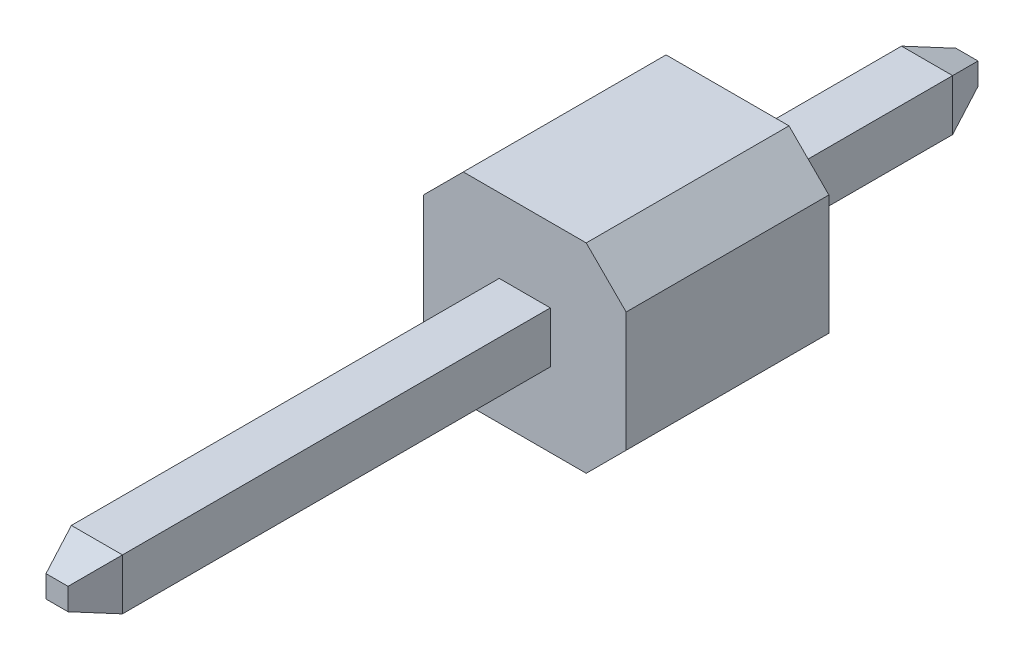
ISO-10303-21;
HEADER;
FILE_DESCRIPTION(('STEP AP214'),'2;1');
FILE_NAME('part.step','',(''),(''),'','','');
FILE_SCHEMA(('AUTOMOTIVE_DESIGN { 1 0 10303 214 1 1 1 1 }'));
ENDSEC;
DATA;
#1=APPLICATION_CONTEXT('core data for automotive mechanical design processes');
#2=APPLICATION_PROTOCOL_DEFINITION('international standard','automotive_design',2000,#1);
#3=PRODUCT_CONTEXT('',#1,'mechanical');
#4=PRODUCT('Part','Part','',(#3));
#5=PRODUCT_RELATED_PRODUCT_CATEGORY('part','',(#4));
#6=PRODUCT_DEFINITION_FORMATION('','',#4);
#7=PRODUCT_DEFINITION_CONTEXT('part definition',#1,'design');
#8=PRODUCT_DEFINITION('design','',#6,#7);
#9=PRODUCT_DEFINITION_SHAPE('','',#8);
#10=(LENGTH_UNIT() NAMED_UNIT(*) SI_UNIT(.MILLI.,.METRE.));
#11=(NAMED_UNIT(*) PLANE_ANGLE_UNIT() SI_UNIT($,.RADIAN.));
#12=(NAMED_UNIT(*) SI_UNIT($,.STERADIAN.) SOLID_ANGLE_UNIT());
#13=UNCERTAINTY_MEASURE_WITH_UNIT(LENGTH_MEASURE(1.E-05),#10,'distance_accuracy_value','');
#14=(GEOMETRIC_REPRESENTATION_CONTEXT(3) GLOBAL_UNCERTAINTY_ASSIGNED_CONTEXT((#13)) GLOBAL_UNIT_ASSIGNED_CONTEXT((#10,
#11,#12)) REPRESENTATION_CONTEXT('',''));
#15=CARTESIAN_POINT('',(0.,0.,0.));
#16=DIRECTION('',(0.,0.,1.));
#17=DIRECTION('',(1.,0.,0.));
#18=AXIS2_PLACEMENT_3D('',#15,#16,#17);
#19=CARTESIAN_POINT('',(0.32384,-0.138014883,-3.));
#20=DIRECTION('',(0.,0.939692620866305,0.342020143104782));
#21=DIRECTION('',(-1.,0.,0.));
#22=AXIS2_PLACEMENT_3D('',#19,#20,#21);
#23=PLANE('',#22);
#24=DIRECTION('',(-1.,0.,0.));
#25=VECTOR('',#24,1.);
#26=CARTESIAN_POINT('',(0.,-0.32,-2.5));
#27=LINE('',#26,#25);
#28=CARTESIAN_POINT('',(0.320000000011604,-0.319999999997679,-2.50000000001275));
#29=VERTEX_POINT('',#28);
#30=CARTESIAN_POINT('',(-0.320000000011604,-0.319999999997679,-2.50000000001275));
#31=VERTEX_POINT('',#30);
#32=EDGE_CURVE('E163',#29,#31,#27,.T.);
#33=ORIENTED_EDGE('',*,*,#32,.T.);
#34=DIRECTION('',(0.323615576989773,0.323615576924206,-0.889126490833329));
#35=VECTOR('',#34,1.);
#36=CARTESIAN_POINT('',(-0.32,-0.319999999981433,-2.50000000005101));
#37=LINE('',#36,#35);
#38=CARTESIAN_POINT('',(-0.138014882990848,-0.138014883,-3.));
#39=VERTEX_POINT('',#38);
#40=EDGE_CURVE('E20',#31,#39,#37,.T.);
#41=ORIENTED_EDGE('',*,*,#40,.T.);
#42=DIRECTION('',(1.,0.,0.));
#43=VECTOR('',#42,1.);
#44=CARTESIAN_POINT('',(0.,-0.138014883,-3.));
#45=LINE('',#44,#43);
#46=CARTESIAN_POINT('',(0.138014882990848,-0.138014883,-3.));
#47=VERTEX_POINT('',#46);
#48=EDGE_CURVE('E189',#39,#47,#45,.T.);
#49=ORIENTED_EDGE('',*,*,#48,.T.);
#50=DIRECTION('',(0.323615576989773,-0.323615576924206,0.889126490833329));
#51=VECTOR('',#50,1.);
#52=CARTESIAN_POINT('',(0.138014883,-0.138014883018305,-2.99999999994971));
#53=LINE('',#52,#51);
#54=EDGE_CURVE('E165',#47,#29,#53,.T.);
#55=ORIENTED_EDGE('',*,*,#54,.T.);
#56=EDGE_LOOP('',(#33,#41,#49,#55));
#57=FACE_BOUND('',#56,.T.);
#58=ADVANCED_FACE('F16',(#57),#23,.F.);
#59=CARTESIAN_POINT('',(-0.77,1.25,0.));
#60=DIRECTION('',(0.,-1.,0.));
#61=DIRECTION('',(1.,0.,0.));
#62=AXIS2_PLACEMENT_3D('',#59,#60,#61);
#63=PLANE('',#62);
#64=DIRECTION('',(0.,0.,-1.));
#65=VECTOR('',#64,1.);
#66=CARTESIAN_POINT('',(0.77,1.25,1.27));
#67=LINE('',#66,#65);
#68=CARTESIAN_POINT('',(0.76999999981,1.25,2.54));
#69=VERTEX_POINT('',#68);
#70=CARTESIAN_POINT('',(0.76999999981,1.25,0.));
#71=VERTEX_POINT('',#70);
#72=EDGE_CURVE('E375',#69,#71,#67,.T.);
#73=ORIENTED_EDGE('',*,*,#72,.T.);
#74=DIRECTION('',(1.,0.,0.));
#75=VECTOR('',#74,1.);
#76=CARTESIAN_POINT('',(0.,1.25,0.));
#77=LINE('',#76,#75);
#78=CARTESIAN_POINT('',(-0.76999999962,1.25,0.));
#79=VERTEX_POINT('',#78);
#80=EDGE_CURVE('E388',#79,#71,#77,.T.);
#81=ORIENTED_EDGE('',*,*,#80,.F.);
#82=DIRECTION('',(0.,0.,1.));
#83=VECTOR('',#82,1.);
#84=CARTESIAN_POINT('',(-0.77,1.25,1.27));
#85=LINE('',#84,#83);
#86=CARTESIAN_POINT('',(-0.76999999981,1.25,2.54));
#87=VERTEX_POINT('',#86);
#88=EDGE_CURVE('E380',#79,#87,#85,.T.);
#89=ORIENTED_EDGE('',*,*,#88,.T.);
#90=DIRECTION('',(-1.,0.,0.));
#91=VECTOR('',#90,1.);
#92=CARTESIAN_POINT('',(0.,1.25,2.54));
#93=LINE('',#92,#91);
#94=EDGE_CURVE('E191',#69,#87,#93,.T.);
#95=ORIENTED_EDGE('',*,*,#94,.F.);
#96=EDGE_LOOP('',(#73,#81,#89,#95));
#97=FACE_BOUND('',#96,.T.);
#98=ADVANCED_FACE('F304',(#97),#63,.F.);
#99=CARTESIAN_POINT('',(-0.138014883,-0.138014883,-3.));
#100=DIRECTION('',(0.,0.,1.));
#101=DIRECTION('',(1.,0.,0.));
#102=AXIS2_PLACEMENT_3D('',#99,#100,#101);
#103=PLANE('',#102);
#104=DIRECTION('',(1.,0.,0.));
#105=VECTOR('',#104,1.);
#106=CARTESIAN_POINT('',(0.,0.138014883,-3.));
#107=LINE('',#106,#105);
#108=CARTESIAN_POINT('',(-0.138014883,0.138014882990848,-3.));
#109=VERTEX_POINT('',#108);
#110=CARTESIAN_POINT('',(0.138014883,0.138014882990848,-3.));
#111=VERTEX_POINT('',#110);
#112=EDGE_CURVE('E202',#109,#111,#107,.T.);
#113=ORIENTED_EDGE('',*,*,#112,.T.);
#114=DIRECTION('',(0.,-1.,0.));
#115=VECTOR('',#114,1.);
#116=CARTESIAN_POINT('',(0.138014883,0.,-3.));
#117=LINE('',#116,#115);
#118=EDGE_CURVE('E161',#111,#47,#117,.T.);
#119=ORIENTED_EDGE('',*,*,#118,.T.);
#120=ORIENTED_EDGE('',*,*,#48,.F.);
#121=DIRECTION('',(0.,1.,0.));
#122=VECTOR('',#121,1.);
#123=CARTESIAN_POINT('',(-0.138014883,0.,-3.));
#124=LINE('',#123,#122);
#125=EDGE_CURVE('E159',#39,#109,#124,.T.);
#126=ORIENTED_EDGE('',*,*,#125,.T.);
#127=EDGE_LOOP('',(#113,#119,#120,#126));
#128=FACE_BOUND('',#127,.T.);
#129=ADVANCED_FACE('F302',(#128),#103,.F.);
#130=CARTESIAN_POINT('',(-0.138014883,-0.32384,-3.));
#131=DIRECTION('',(0.939692620866305,0.,0.342020143104782));
#132=DIRECTION('',(0.,1.,0.));
#133=AXIS2_PLACEMENT_3D('',#130,#131,#132);
#134=PLANE('',#133);
#135=DIRECTION('',(0.,1.,0.));
#136=VECTOR('',#135,1.);
#137=CARTESIAN_POINT('',(-0.32,0.,-2.5));
#138=LINE('',#137,#136);
#139=CARTESIAN_POINT('',(-0.319999999997679,0.320000000011604,-2.50000000001275));
#140=VERTEX_POINT('',#139);
#141=EDGE_CURVE('E156',#31,#140,#138,.T.);
#142=ORIENTED_EDGE('',*,*,#141,.T.);
#143=DIRECTION('',(0.323615576924206,-0.323615576989773,-0.889126490833329));
#144=VECTOR('',#143,1.);
#145=CARTESIAN_POINT('',(-0.319999999981433,0.32,-2.50000000005101));
#146=LINE('',#145,#144);
#147=EDGE_CURVE('E201',#140,#109,#146,.T.);
#148=ORIENTED_EDGE('',*,*,#147,.T.);
#149=ORIENTED_EDGE('',*,*,#125,.F.);
#150=ORIENTED_EDGE('',*,*,#40,.F.);
#151=EDGE_LOOP('',(#142,#148,#149,#150));
#152=FACE_BOUND('',#151,.T.);
#153=ADVANCED_FACE('F153',(#152),#134,.F.);
#154=CARTESIAN_POINT('',(0.138014883,0.32384,-3.));
#155=DIRECTION('',(-0.939692620866305,0.,0.342020143104782));
#156=DIRECTION('',(0.,-1.,0.));
#157=AXIS2_PLACEMENT_3D('',#154,#155,#156);
#158=PLANE('',#157);
#159=ORIENTED_EDGE('',*,*,#118,.F.);
#160=DIRECTION('',(0.323615576924206,0.323615576989773,0.889126490833329));
#161=VECTOR('',#160,1.);
#162=CARTESIAN_POINT('',(0.138014883018305,0.138014883,-2.99999999994971));
#163=LINE('',#162,#161);
#164=CARTESIAN_POINT('',(0.319999999997679,0.320000000011604,-2.50000000001275));
#165=VERTEX_POINT('',#164);
#166=EDGE_CURVE('E205',#111,#165,#163,.T.);
#167=ORIENTED_EDGE('',*,*,#166,.T.);
#168=DIRECTION('',(0.,-1.,0.));
#169=VECTOR('',#168,1.);
#170=CARTESIAN_POINT('',(0.32,0.,-2.5));
#171=LINE('',#170,#169);
#172=EDGE_CURVE('E198',#165,#29,#171,.T.);
#173=ORIENTED_EDGE('',*,*,#172,.T.);
#174=ORIENTED_EDGE('',*,*,#54,.F.);
#175=EDGE_LOOP('',(#159,#167,#173,#174));
#176=FACE_BOUND('',#175,.T.);
#177=ADVANCED_FACE('F291',(#176),#158,.F.);
#178=CARTESIAN_POINT('',(-0.32,-0.32,-2.5));
#179=DIRECTION('',(0.,1.,0.));
#180=DIRECTION('',(0.,0.,1.));
#181=AXIS2_PLACEMENT_3D('',#178,#179,#180);
#182=PLANE('',#181);
#183=DIRECTION('',(0.,0.,-1.));
#184=VECTOR('',#183,1.);
#185=CARTESIAN_POINT('',(-0.32,-0.32,-1.25));
#186=LINE('',#185,#184);
#187=CARTESIAN_POINT('',(-0.32000000002,-0.32,0.));
#188=VERTEX_POINT('',#187);
#189=EDGE_CURVE('E176',#188,#31,#186,.T.);
#190=ORIENTED_EDGE('',*,*,#189,.T.);
#191=ORIENTED_EDGE('',*,*,#32,.F.);
#192=DIRECTION('',(0.,0.,1.));
#193=VECTOR('',#192,1.);
#194=CARTESIAN_POINT('',(0.32,-0.32,-1.25));
#195=LINE('',#194,#193);
#196=CARTESIAN_POINT('',(0.32000000002,-0.32,0.));
#197=VERTEX_POINT('',#196);
#198=EDGE_CURVE('E195',#29,#197,#195,.T.);
#199=ORIENTED_EDGE('',*,*,#198,.T.);
#200=DIRECTION('',(1.,0.,0.));
#201=VECTOR('',#200,1.);
#202=CARTESIAN_POINT('',(0.,-0.32,0.));
#203=LINE('',#202,#201);
#204=EDGE_CURVE('E170',#188,#197,#203,.T.);
#205=ORIENTED_EDGE('',*,*,#204,.F.);
#206=EDGE_LOOP('',(#190,#191,#199,#205));
#207=FACE_BOUND('',#206,.T.);
#208=ADVANCED_FACE('F182',(#207),#182,.F.);
#209=CARTESIAN_POINT('',(-1.27,0.75,2.54));
#210=DIRECTION('',(0.707106781186547,-0.707106781186548,0.));
#211=DIRECTION('',(0.,0.,-1.));
#212=AXIS2_PLACEMENT_3D('',#209,#210,#211);
#213=PLANE('',#212);
#214=ORIENTED_EDGE('',*,*,#88,.F.);
#215=DIRECTION('',(0.707106781186548,0.707106781186548,0.));
#216=VECTOR('',#215,1.);
#217=CARTESIAN_POINT('',(-1.02,1.,0.));
#218=LINE('',#217,#216);
#219=CARTESIAN_POINT('',(-1.27,0.75,0.));
#220=VERTEX_POINT('',#219);
#221=EDGE_CURVE('E383',#220,#79,#218,.T.);
#222=ORIENTED_EDGE('',*,*,#221,.F.);
#223=DIRECTION('',(0.,0.,1.));
#224=VECTOR('',#223,1.);
#225=CARTESIAN_POINT('',(-1.27,0.75,1.27));
#226=LINE('',#225,#224);
#227=CARTESIAN_POINT('',(-1.27,0.75,2.54));
#228=VERTEX_POINT('',#227);
#229=EDGE_CURVE('E233',#220,#228,#226,.T.);
#230=ORIENTED_EDGE('',*,*,#229,.T.);
#231=DIRECTION('',(-0.707106781186548,-0.707106781186548,0.));
#232=VECTOR('',#231,1.);
#233=CARTESIAN_POINT('',(-1.02,1.,2.54));
#234=LINE('',#233,#232);
#235=EDGE_CURVE('E378',#87,#228,#234,.T.);
#236=ORIENTED_EDGE('',*,*,#235,.F.);
#237=EDGE_LOOP('',(#214,#222,#230,#236));
#238=FACE_BOUND('',#237,.T.);
#239=ADVANCED_FACE('F401',(#238),#213,.F.);
#240=CARTESIAN_POINT('',(0.77,1.25,2.54));
#241=DIRECTION('',(-0.707106781186547,-0.707106781186548,0.));
#242=DIRECTION('',(0.,0.,-1.));
#243=AXIS2_PLACEMENT_3D('',#240,#241,#242);
#244=PLANE('',#243);
#245=DIRECTION('',(0.,0.,-1.));
#246=VECTOR('',#245,1.);
#247=CARTESIAN_POINT('',(1.27,0.75,1.27));
#248=LINE('',#247,#246);
#249=CARTESIAN_POINT('',(1.27,0.75,2.54));
#250=VERTEX_POINT('',#249);
#251=CARTESIAN_POINT('',(1.27,0.75,0.));
#252=VERTEX_POINT('',#251);
#253=EDGE_CURVE('E224',#250,#252,#248,.T.);
#254=ORIENTED_EDGE('',*,*,#253,.T.);
#255=DIRECTION('',(0.707106781186548,-0.707106781186548,0.));
#256=VECTOR('',#255,1.);
#257=CARTESIAN_POINT('',(1.02,1.,0.));
#258=LINE('',#257,#256);
#259=EDGE_CURVE('E186',#71,#252,#258,.T.);
#260=ORIENTED_EDGE('',*,*,#259,.F.);
#261=ORIENTED_EDGE('',*,*,#72,.F.);
#262=DIRECTION('',(-0.707106781186548,0.707106781186548,0.));
#263=VECTOR('',#262,1.);
#264=CARTESIAN_POINT('',(1.02,1.,2.54));
#265=LINE('',#264,#263);
#266=EDGE_CURVE('E183',#250,#69,#265,.T.);
#267=ORIENTED_EDGE('',*,*,#266,.F.);
#268=EDGE_LOOP('',(#254,#260,#261,#267));
#269=FACE_BOUND('',#268,.T.);
#270=ADVANCED_FACE('F396',(#269),#244,.F.);
#271=CARTESIAN_POINT('',(-0.32,-0.32,-2.5));
#272=DIRECTION('',(1.,0.,0.));
#273=DIRECTION('',(0.,1.,0.));
#274=AXIS2_PLACEMENT_3D('',#271,#272,#273);
#275=PLANE('',#274);
#276=DIRECTION('',(0.,0.,-1.));
#277=VECTOR('',#276,1.);
#278=CARTESIAN_POINT('',(-0.32,0.32,-1.25));
#279=LINE('',#278,#277);
#280=CARTESIAN_POINT('',(-0.32000000002,0.32,0.));
#281=VERTEX_POINT('',#280);
#282=EDGE_CURVE('E179',#281,#140,#279,.T.);
#283=ORIENTED_EDGE('',*,*,#282,.T.);
#284=ORIENTED_EDGE('',*,*,#141,.F.);
#285=ORIENTED_EDGE('',*,*,#189,.F.);
#286=DIRECTION('',(0.,-1.,0.));
#287=VECTOR('',#286,1.);
#288=CARTESIAN_POINT('',(-0.32,0.,0.));
#289=LINE('',#288,#287);
#290=EDGE_CURVE('E180',#281,#188,#289,.T.);
#291=ORIENTED_EDGE('',*,*,#290,.F.);
#292=EDGE_LOOP('',(#283,#284,#285,#291));
#293=FACE_BOUND('',#292,.T.);
#294=ADVANCED_FACE('F175',(#293),#275,.F.);
#295=CARTESIAN_POINT('',(-0.32384,0.138014883,-3.));
#296=DIRECTION('',(0.,-0.939692620866305,0.342020143104782));
#297=DIRECTION('',(1.,0.,0.));
#298=AXIS2_PLACEMENT_3D('',#295,#296,#297);
#299=PLANE('',#298);
#300=DIRECTION('',(1.,0.,0.));
#301=VECTOR('',#300,1.);
#302=CARTESIAN_POINT('',(0.,0.32,-2.5));
#303=LINE('',#302,#301);
#304=EDGE_CURVE('E210',#140,#165,#303,.T.);
#305=ORIENTED_EDGE('',*,*,#304,.T.);
#306=ORIENTED_EDGE('',*,*,#166,.F.);
#307=ORIENTED_EDGE('',*,*,#112,.F.);
#308=ORIENTED_EDGE('',*,*,#147,.F.);
#309=EDGE_LOOP('',(#305,#306,#307,#308));
#310=FACE_BOUND('',#309,.T.);
#311=ADVANCED_FACE('F299',(#310),#299,.F.);
#312=CARTESIAN_POINT('',(0.32,-0.32,-2.5));
#313=DIRECTION('',(-1.,0.,0.));
#314=DIRECTION('',(0.,0.,1.));
#315=AXIS2_PLACEMENT_3D('',#312,#313,#314);
#316=PLANE('',#315);
#317=ORIENTED_EDGE('',*,*,#198,.F.);
#318=ORIENTED_EDGE('',*,*,#172,.F.);
#319=DIRECTION('',(0.,0.,1.));
#320=VECTOR('',#319,1.);
#321=CARTESIAN_POINT('',(0.32,0.32,-1.25));
#322=LINE('',#321,#320);
#323=CARTESIAN_POINT('',(0.32000000002,0.32,0.));
#324=VERTEX_POINT('',#323);
#325=EDGE_CURVE('E206',#165,#324,#322,.T.);
#326=ORIENTED_EDGE('',*,*,#325,.T.);
#327=DIRECTION('',(0.,1.,0.));
#328=VECTOR('',#327,1.);
#329=CARTESIAN_POINT('',(0.32,0.,0.));
#330=LINE('',#329,#328);
#331=EDGE_CURVE('E197',#197,#324,#330,.T.);
#332=ORIENTED_EDGE('',*,*,#331,.F.);
#333=EDGE_LOOP('',(#317,#318,#326,#332));
#334=FACE_BOUND('',#333,.T.);
#335=ADVANCED_FACE('F427',(#334),#316,.F.);
#336=CARTESIAN_POINT('',(-1.27,-0.75,2.54));
#337=DIRECTION('',(1.,0.,0.));
#338=DIRECTION('',(0.,0.,-1.));
#339=AXIS2_PLACEMENT_3D('',#336,#337,#338);
#340=PLANE('',#339);
#341=ORIENTED_EDGE('',*,*,#229,.F.);
#342=DIRECTION('',(0.,1.,0.));
#343=VECTOR('',#342,1.);
#344=CARTESIAN_POINT('',(-1.27,0.,0.));
#345=LINE('',#344,#343);
#346=CARTESIAN_POINT('',(-1.27,-0.75,0.));
#347=VERTEX_POINT('',#346);
#348=EDGE_CURVE('E230',#347,#220,#345,.T.);
#349=ORIENTED_EDGE('',*,*,#348,.F.);
#350=DIRECTION('',(0.,0.,1.));
#351=VECTOR('',#350,1.);
#352=CARTESIAN_POINT('',(-1.27,-0.75,1.27));
#353=LINE('',#352,#351);
#354=CARTESIAN_POINT('',(-1.27,-0.75,2.54));
#355=VERTEX_POINT('',#354);
#356=EDGE_CURVE('E209',#347,#355,#353,.T.);
#357=ORIENTED_EDGE('',*,*,#356,.T.);
#358=DIRECTION('',(0.,-1.,0.));
#359=VECTOR('',#358,1.);
#360=CARTESIAN_POINT('',(-1.27,0.,2.54));
#361=LINE('',#360,#359);
#362=EDGE_CURVE('E368',#228,#355,#361,.T.);
#363=ORIENTED_EDGE('',*,*,#362,.F.);
#364=EDGE_LOOP('',(#341,#349,#357,#363));
#365=FACE_BOUND('',#364,.T.);
#366=ADVANCED_FACE('F404',(#365),#340,.F.);
#367=CARTESIAN_POINT('',(1.27,-0.75,0.));
#368=DIRECTION('',(-1.,0.,0.));
#369=DIRECTION('',(0.,0.,1.));
#370=AXIS2_PLACEMENT_3D('',#367,#368,#369);
#371=PLANE('',#370);
#372=ORIENTED_EDGE('',*,*,#253,.F.);
#373=DIRECTION('',(0.,1.,0.));
#374=VECTOR('',#373,1.);
#375=CARTESIAN_POINT('',(1.27,0.,2.54));
#376=LINE('',#375,#374);
#377=CARTESIAN_POINT('',(1.27,-0.75,2.54));
#378=VERTEX_POINT('',#377);
#379=EDGE_CURVE('E365',#378,#250,#376,.T.);
#380=ORIENTED_EDGE('',*,*,#379,.F.);
#381=DIRECTION('',(0.,0.,-1.));
#382=VECTOR('',#381,1.);
#383=CARTESIAN_POINT('',(1.27,-0.75,1.27));
#384=LINE('',#383,#382);
#385=CARTESIAN_POINT('',(1.27,-0.75,0.));
#386=VERTEX_POINT('',#385);
#387=EDGE_CURVE('E225',#378,#386,#384,.T.);
#388=ORIENTED_EDGE('',*,*,#387,.T.);
#389=DIRECTION('',(0.,-1.,0.));
#390=VECTOR('',#389,1.);
#391=CARTESIAN_POINT('',(1.27,0.,0.));
#392=LINE('',#391,#390);
#393=EDGE_CURVE('E214',#252,#386,#392,.T.);
#394=ORIENTED_EDGE('',*,*,#393,.F.);
#395=EDGE_LOOP('',(#372,#380,#388,#394));
#396=FACE_BOUND('',#395,.T.);
#397=ADVANCED_FACE('F419',(#396),#371,.F.);
#398=CARTESIAN_POINT('',(-0.32,0.32,0.));
#399=DIRECTION('',(0.,-1.,0.));
#400=DIRECTION('',(0.,0.,-1.));
#401=AXIS2_PLACEMENT_3D('',#398,#399,#400);
#402=PLANE('',#401);
#403=ORIENTED_EDGE('',*,*,#325,.F.);
#404=ORIENTED_EDGE('',*,*,#304,.F.);
#405=ORIENTED_EDGE('',*,*,#282,.F.);
#406=DIRECTION('',(1.,0.,0.));
#407=VECTOR('',#406,1.);
#408=CARTESIAN_POINT('',(0.,0.32,0.));
#409=LINE('',#408,#407);
#410=EDGE_CURVE('E255',#281,#324,#409,.T.);
#411=ORIENTED_EDGE('',*,*,#410,.T.);
#412=EDGE_LOOP('',(#403,#404,#405,#411));
#413=FACE_BOUND('',#412,.T.);
#414=ADVANCED_FACE('F295',(#413),#402,.F.);
#415=CARTESIAN_POINT('',(-0.77,-1.25,2.54));
#416=DIRECTION('',(0.707106781186547,0.707106781186548,0.));
#417=DIRECTION('',(0.,0.,-1.));
#418=AXIS2_PLACEMENT_3D('',#415,#416,#417);
#419=PLANE('',#418);
#420=ORIENTED_EDGE('',*,*,#356,.F.);
#421=DIRECTION('',(-0.707106781186548,0.707106781186547,0.));
#422=VECTOR('',#421,1.);
#423=CARTESIAN_POINT('',(-0.77,-1.25,0.));
#424=LINE('',#423,#422);
#425=CARTESIAN_POINT('',(-0.77,-1.25,0.));
#426=VERTEX_POINT('',#425);
#427=EDGE_CURVE('E283',#347,#426,#424,.F.);
#428=ORIENTED_EDGE('',*,*,#427,.T.);
#429=DIRECTION('',(0.,0.,1.));
#430=VECTOR('',#429,1.);
#431=CARTESIAN_POINT('',(-0.77,-1.25,1.27));
#432=LINE('',#431,#430);
#433=CARTESIAN_POINT('',(-0.76999999981,-1.25,2.54));
#434=VERTEX_POINT('',#433);
#435=EDGE_CURVE('E222',#426,#434,#432,.T.);
#436=ORIENTED_EDGE('',*,*,#435,.T.);
#437=DIRECTION('',(0.707106781186548,-0.707106781186548,0.));
#438=VECTOR('',#437,1.);
#439=CARTESIAN_POINT('',(-1.02,-1.,2.54));
#440=LINE('',#439,#438);
#441=EDGE_CURVE('E229',#355,#434,#440,.T.);
#442=ORIENTED_EDGE('',*,*,#441,.F.);
#443=EDGE_LOOP('',(#420,#428,#436,#442));
#444=FACE_BOUND('',#443,.T.);
#445=ADVANCED_FACE('F409',(#444),#419,.F.);
#446=CARTESIAN_POINT('',(1.27,-0.75,2.54));
#447=DIRECTION('',(-0.707106781186547,0.707106781186548,0.));
#448=DIRECTION('',(0.,0.,-1.));
#449=AXIS2_PLACEMENT_3D('',#446,#447,#448);
#450=PLANE('',#449);
#451=DIRECTION('',(0.,0.,-1.));
#452=VECTOR('',#451,1.);
#453=CARTESIAN_POINT('',(0.77,-1.25,1.27));
#454=LINE('',#453,#452);
#455=CARTESIAN_POINT('',(0.76999999981,-1.25,2.54));
#456=VERTEX_POINT('',#455);
#457=CARTESIAN_POINT('',(0.77,-1.25,0.));
#458=VERTEX_POINT('',#457);
#459=EDGE_CURVE('E219',#456,#458,#454,.T.);
#460=ORIENTED_EDGE('',*,*,#459,.T.);
#461=DIRECTION('',(-0.707106781186548,-0.707106781186547,0.));
#462=VECTOR('',#461,1.);
#463=CARTESIAN_POINT('',(1.27,-0.75,0.));
#464=LINE('',#463,#462);
#465=EDGE_CURVE('E280',#458,#386,#464,.F.);
#466=ORIENTED_EDGE('',*,*,#465,.T.);
#467=ORIENTED_EDGE('',*,*,#387,.F.);
#468=DIRECTION('',(0.707106781186548,0.707106781186548,0.));
#469=VECTOR('',#468,1.);
#470=CARTESIAN_POINT('',(1.02,-1.,2.54));
#471=LINE('',#470,#469);
#472=EDGE_CURVE('E228',#456,#378,#471,.T.);
#473=ORIENTED_EDGE('',*,*,#472,.F.);
#474=EDGE_LOOP('',(#460,#466,#467,#473));
#475=FACE_BOUND('',#474,.T.);
#476=ADVANCED_FACE('F416',(#475),#450,.F.);
#477=CARTESIAN_POINT('',(-1.27,-1.25,0.));
#478=DIRECTION('',(0.,0.,1.));
#479=DIRECTION('',(1.,0.,0.));
#480=AXIS2_PLACEMENT_3D('',#477,#478,#479);
#481=PLANE('',#480);
#482=ORIENTED_EDGE('',*,*,#290,.T.);
#483=ORIENTED_EDGE('',*,*,#204,.T.);
#484=ORIENTED_EDGE('',*,*,#331,.T.);
#485=ORIENTED_EDGE('',*,*,#410,.F.);
#486=EDGE_LOOP('',(#482,#483,#484,#485));
#487=FACE_BOUND('',#486,.T.);
#488=ORIENTED_EDGE('',*,*,#259,.T.);
#489=ORIENTED_EDGE('',*,*,#393,.T.);
#490=ORIENTED_EDGE('',*,*,#465,.F.);
#491=DIRECTION('',(-1.,0.,0.));
#492=VECTOR('',#491,1.);
#493=CARTESIAN_POINT('',(0.,-1.25,0.));
#494=LINE('',#493,#492);
#495=EDGE_CURVE('E215',#458,#426,#494,.T.);
#496=ORIENTED_EDGE('',*,*,#495,.T.);
#497=ORIENTED_EDGE('',*,*,#427,.F.);
#498=ORIENTED_EDGE('',*,*,#348,.T.);
#499=ORIENTED_EDGE('',*,*,#221,.T.);
#500=ORIENTED_EDGE('',*,*,#80,.T.);
#501=EDGE_LOOP('',(#488,#489,#490,#496,#497,#498,#499,#500));
#502=FACE_BOUND('',#501,.T.);
#503=ADVANCED_FACE('F391',(#487,#502),#481,.F.);
#504=CARTESIAN_POINT('',(0.138014883,0.32384,8.4));
#505=DIRECTION('',(0.939692620866305,0.,0.342020143104782));
#506=DIRECTION('',(0.,-1.,0.));
#507=AXIS2_PLACEMENT_3D('',#504,#505,#506);
#508=PLANE('',#507);
#509=DIRECTION('',(0.323615576429267,0.323615576989772,-0.889126491013472));
#510=VECTOR('',#509,1.);
#511=CARTESIAN_POINT('',(0.13801488315648,0.138014883,8.4));
#512=LINE('',#511,#510);
#513=CARTESIAN_POINT('',(0.13801488307824,0.138014883,8.4));
#514=VERTEX_POINT('',#513);
#515=CARTESIAN_POINT('',(0.3199999999008,0.32000000001984,7.89999999989098));
#516=VERTEX_POINT('',#515);
#517=EDGE_CURVE('E243',#514,#516,#512,.T.);
#518=ORIENTED_EDGE('',*,*,#517,.F.);
#519=DIRECTION('',(0.,1.,0.));
#520=VECTOR('',#519,1.);
#521=CARTESIAN_POINT('',(0.138014883,0.,8.4));
#522=LINE('',#521,#520);
#523=CARTESIAN_POINT('',(0.13801488307824,-0.138014883,8.4));
#524=VERTEX_POINT('',#523);
#525=EDGE_CURVE('E252',#524,#514,#522,.T.);
#526=ORIENTED_EDGE('',*,*,#525,.F.);
#527=DIRECTION('',(-0.323615576429267,0.323615576989772,0.889126491013472));
#528=VECTOR('',#527,1.);
#529=CARTESIAN_POINT('',(0.31999999984128,-0.32,7.9));
#530=LINE('',#529,#528);
#531=CARTESIAN_POINT('',(0.3199999999008,-0.32000000001984,7.89999999989098));
#532=VERTEX_POINT('',#531);
#533=EDGE_CURVE('E254',#532,#524,#530,.T.);
#534=ORIENTED_EDGE('',*,*,#533,.F.);
#535=DIRECTION('',(0.,1.,0.));
#536=VECTOR('',#535,1.);
#537=CARTESIAN_POINT('',(0.32,0.,7.9));
#538=LINE('',#537,#536);
#539=EDGE_CURVE('E239',#532,#516,#538,.T.);
#540=ORIENTED_EDGE('',*,*,#539,.T.);
#541=EDGE_LOOP('',(#518,#526,#534,#540));
#542=FACE_BOUND('',#541,.T.);
#543=ADVANCED_FACE('F347',(#542),#508,.T.);
#544=CARTESIAN_POINT('',(-0.138014883,-0.138014883,8.4));
#545=DIRECTION('',(0.,0.,1.));
#546=DIRECTION('',(1.,0.,0.));
#547=AXIS2_PLACEMENT_3D('',#544,#545,#546);
#548=PLANE('',#547);
#549=DIRECTION('',(1.,0.,0.));
#550=VECTOR('',#549,1.);
#551=CARTESIAN_POINT('',(0.,0.138014883,8.4));
#552=LINE('',#551,#550);
#553=CARTESIAN_POINT('',(-0.138014883,0.13801488307824,8.4));
#554=VERTEX_POINT('',#553);
#555=EDGE_CURVE('E218',#554,#514,#552,.T.);
#556=ORIENTED_EDGE('',*,*,#555,.F.);
#557=DIRECTION('',(0.,1.,0.));
#558=VECTOR('',#557,1.);
#559=CARTESIAN_POINT('',(-0.138014883,0.,8.4));
#560=LINE('',#559,#558);
#561=CARTESIAN_POINT('',(-0.138014883,-0.13801488307824,8.4));
#562=VERTEX_POINT('',#561);
#563=EDGE_CURVE('E251',#562,#554,#560,.T.);
#564=ORIENTED_EDGE('',*,*,#563,.F.);
#565=DIRECTION('',(-1.,0.,0.));
#566=VECTOR('',#565,1.);
#567=CARTESIAN_POINT('',(0.,-0.138014883,8.4));
#568=LINE('',#567,#566);
#569=EDGE_CURVE('E238',#524,#562,#568,.T.);
#570=ORIENTED_EDGE('',*,*,#569,.F.);
#571=ORIENTED_EDGE('',*,*,#525,.T.);
#572=EDGE_LOOP('',(#556,#564,#570,#571));
#573=FACE_BOUND('',#572,.T.);
#574=ADVANCED_FACE('F340',(#573),#548,.T.);
#575=CARTESIAN_POINT('',(0.32384,-0.138014883,8.4));
#576=DIRECTION('',(0.,-0.939692620866305,0.342020143104782));
#577=DIRECTION('',(-1.,0.,0.));
#578=AXIS2_PLACEMENT_3D('',#575,#576,#577);
#579=PLANE('',#578);
#580=ORIENTED_EDGE('',*,*,#533,.T.);
#581=ORIENTED_EDGE('',*,*,#569,.T.);
#582=DIRECTION('',(0.323615576989772,0.323615576429267,0.889126491013472));
#583=VECTOR('',#582,1.);
#584=CARTESIAN_POINT('',(-0.32,-0.31999999984128,7.9));
#585=LINE('',#584,#583);
#586=CARTESIAN_POINT('',(-0.32000000001984,-0.3199999999008,7.89999999989098));
#587=VERTEX_POINT('',#586);
#588=EDGE_CURVE('E273',#587,#562,#585,.T.);
#589=ORIENTED_EDGE('',*,*,#588,.F.);
#590=DIRECTION('',(1.,0.,0.));
#591=VECTOR('',#590,1.);
#592=CARTESIAN_POINT('',(0.,-0.32,7.9));
#593=LINE('',#592,#591);
#594=EDGE_CURVE('E248',#587,#532,#593,.T.);
#595=ORIENTED_EDGE('',*,*,#594,.T.);
#596=EDGE_LOOP('',(#580,#581,#589,#595));
#597=FACE_BOUND('',#596,.T.);
#598=ADVANCED_FACE('F333',(#597),#579,.T.);
#599=CARTESIAN_POINT('',(0.77,-1.25,0.));
#600=DIRECTION('',(0.,1.,0.));
#601=DIRECTION('',(-1.,0.,0.));
#602=AXIS2_PLACEMENT_3D('',#599,#600,#601);
#603=PLANE('',#602);
#604=ORIENTED_EDGE('',*,*,#459,.F.);
#605=DIRECTION('',(1.,0.,0.));
#606=VECTOR('',#605,1.);
#607=CARTESIAN_POINT('',(0.,-1.25,2.54));
#608=LINE('',#607,#606);
#609=EDGE_CURVE('E247',#434,#456,#608,.T.);
#610=ORIENTED_EDGE('',*,*,#609,.F.);
#611=ORIENTED_EDGE('',*,*,#435,.F.);
#612=ORIENTED_EDGE('',*,*,#495,.F.);
#613=EDGE_LOOP('',(#604,#610,#611,#612));
#614=FACE_BOUND('',#613,.T.);
#615=ADVANCED_FACE('F414',(#614),#603,.F.);
#616=CARTESIAN_POINT('',(-0.32384,0.138014883,8.4));
#617=DIRECTION('',(0.,0.939692620866305,0.342020143104782));
#618=DIRECTION('',(1.,0.,0.));
#619=AXIS2_PLACEMENT_3D('',#616,#617,#618);
#620=PLANE('',#619);
#621=ORIENTED_EDGE('',*,*,#517,.T.);
#622=DIRECTION('',(-1.,0.,0.));
#623=VECTOR('',#622,1.);
#624=CARTESIAN_POINT('',(0.,0.32,7.9));
#625=LINE('',#624,#623);
#626=CARTESIAN_POINT('',(-0.32000000001984,0.3199999999008,7.89999999989098));
#627=VERTEX_POINT('',#626);
#628=EDGE_CURVE('E259',#516,#627,#625,.T.);
#629=ORIENTED_EDGE('',*,*,#628,.T.);
#630=DIRECTION('',(-0.323615576989772,0.323615576429267,-0.889126491013472));
#631=VECTOR('',#630,1.);
#632=CARTESIAN_POINT('',(-0.138014883,0.13801488315648,8.4));
#633=LINE('',#632,#631);
#634=EDGE_CURVE('E242',#554,#627,#633,.T.);
#635=ORIENTED_EDGE('',*,*,#634,.F.);
#636=ORIENTED_EDGE('',*,*,#555,.T.);
#637=EDGE_LOOP('',(#621,#629,#635,#636));
#638=FACE_BOUND('',#637,.T.);
#639=ADVANCED_FACE('F344',(#638),#620,.T.);
#640=CARTESIAN_POINT('',(0.32,-0.32,2.54));
#641=DIRECTION('',(-1.,0.,0.));
#642=DIRECTION('',(0.,0.,1.));
#643=AXIS2_PLACEMENT_3D('',#640,#641,#642);
#644=PLANE('',#643);
#645=DIRECTION('',(0.,-1.,0.));
#646=VECTOR('',#645,1.);
#647=CARTESIAN_POINT('',(0.320000000080001,0.,2.54));
#648=LINE('',#647,#646);
#649=CARTESIAN_POINT('',(0.32000000004,0.32,2.54));
#650=VERTEX_POINT('',#649);
#651=CARTESIAN_POINT('',(0.32000000002,-0.32,2.54));
#652=VERTEX_POINT('',#651);
#653=EDGE_CURVE('E351',#650,#652,#648,.T.);
#654=ORIENTED_EDGE('',*,*,#653,.F.);
#655=DIRECTION('',(0.,0.,1.));
#656=VECTOR('',#655,1.);
#657=CARTESIAN_POINT('',(0.32,0.32,5.22));
#658=LINE('',#657,#656);
#659=EDGE_CURVE('E263',#650,#516,#658,.T.);
#660=ORIENTED_EDGE('',*,*,#659,.T.);
#661=ORIENTED_EDGE('',*,*,#539,.F.);
#662=DIRECTION('',(0.,0.,-1.));
#663=VECTOR('',#662,1.);
#664=CARTESIAN_POINT('',(0.32,-0.32,5.22));
#665=LINE('',#664,#663);
#666=EDGE_CURVE('E244',#532,#652,#665,.T.);
#667=ORIENTED_EDGE('',*,*,#666,.T.);
#668=EDGE_LOOP('',(#654,#660,#661,#667));
#669=FACE_BOUND('',#668,.T.);
#670=ADVANCED_FACE('F350',(#669),#644,.F.);
#671=CARTESIAN_POINT('',(-0.138014883,-0.32384,8.4));
#672=DIRECTION('',(-0.939692620866305,0.,0.342020143104782));
#673=DIRECTION('',(0.,1.,0.));
#674=AXIS2_PLACEMENT_3D('',#671,#672,#673);
#675=PLANE('',#674);
#676=ORIENTED_EDGE('',*,*,#588,.T.);
#677=ORIENTED_EDGE('',*,*,#563,.T.);
#678=ORIENTED_EDGE('',*,*,#634,.T.);
#679=DIRECTION('',(0.,-1.,0.));
#680=VECTOR('',#679,1.);
#681=CARTESIAN_POINT('',(-0.32,0.,7.9));
#682=LINE('',#681,#680);
#683=EDGE_CURVE('E266',#627,#587,#682,.T.);
#684=ORIENTED_EDGE('',*,*,#683,.T.);
#685=EDGE_LOOP('',(#676,#677,#678,#684));
#686=FACE_BOUND('',#685,.T.);
#687=ADVANCED_FACE('F337',(#686),#675,.T.);
#688=CARTESIAN_POINT('',(-0.32,-0.32,2.54));
#689=DIRECTION('',(0.,1.,0.));
#690=DIRECTION('',(0.,0.,1.));
#691=AXIS2_PLACEMENT_3D('',#688,#689,#690);
#692=PLANE('',#691);
#693=DIRECTION('',(-1.,0.,0.));
#694=VECTOR('',#693,1.);
#695=CARTESIAN_POINT('',(0.,-0.32,2.54));
#696=LINE('',#695,#694);
#697=CARTESIAN_POINT('',(-0.32000000002,-0.32,2.54));
#698=VERTEX_POINT('',#697);
#699=EDGE_CURVE('E262',#652,#698,#696,.T.);
#700=ORIENTED_EDGE('',*,*,#699,.F.);
#701=ORIENTED_EDGE('',*,*,#666,.F.);
#702=ORIENTED_EDGE('',*,*,#594,.F.);
#703=DIRECTION('',(0.,0.,-1.));
#704=VECTOR('',#703,1.);
#705=CARTESIAN_POINT('',(-0.32,-0.32,5.22));
#706=LINE('',#705,#704);
#707=EDGE_CURVE('E267',#587,#698,#706,.T.);
#708=ORIENTED_EDGE('',*,*,#707,.T.);
#709=EDGE_LOOP('',(#700,#701,#702,#708));
#710=FACE_BOUND('',#709,.T.);
#711=ADVANCED_FACE('F329',(#710),#692,.F.);
#712=CARTESIAN_POINT('',(-1.27,-1.25,2.54));
#713=DIRECTION('',(0.,0.,1.));
#714=DIRECTION('',(1.,0.,0.));
#715=AXIS2_PLACEMENT_3D('',#712,#713,#714);
#716=PLANE('',#715);
#717=ORIENTED_EDGE('',*,*,#653,.T.);
#718=ORIENTED_EDGE('',*,*,#699,.T.);
#719=DIRECTION('',(0.,1.,0.));
#720=VECTOR('',#719,1.);
#721=CARTESIAN_POINT('',(-0.32,0.,2.54));
#722=LINE('',#721,#720);
#723=CARTESIAN_POINT('',(-0.32000000004,0.32,2.54));
#724=VERTEX_POINT('',#723);
#725=EDGE_CURVE('E26',#698,#724,#722,.T.);
#726=ORIENTED_EDGE('',*,*,#725,.T.);
#727=DIRECTION('',(1.,0.,0.));
#728=VECTOR('',#727,1.);
#729=CARTESIAN_POINT('',(0.,0.32,2.54));
#730=LINE('',#729,#728);
#731=EDGE_CURVE('E34',#724,#650,#730,.T.);
#732=ORIENTED_EDGE('',*,*,#731,.T.);
#733=EDGE_LOOP('',(#717,#718,#726,#732));
#734=FACE_BOUND('',#733,.T.);
#735=ORIENTED_EDGE('',*,*,#609,.T.);
#736=ORIENTED_EDGE('',*,*,#472,.T.);
#737=ORIENTED_EDGE('',*,*,#379,.T.);
#738=ORIENTED_EDGE('',*,*,#266,.T.);
#739=ORIENTED_EDGE('',*,*,#94,.T.);
#740=ORIENTED_EDGE('',*,*,#235,.T.);
#741=ORIENTED_EDGE('',*,*,#362,.T.);
#742=ORIENTED_EDGE('',*,*,#441,.T.);
#743=EDGE_LOOP('',(#735,#736,#737,#738,#739,#740,#741,#742));
#744=FACE_BOUND('',#743,.T.);
#745=ADVANCED_FACE('F320',(#734,#744),#716,.T.);
#746=CARTESIAN_POINT('',(-0.32,0.32,7.9));
#747=DIRECTION('',(0.,-1.,0.));
#748=DIRECTION('',(0.,0.,-1.));
#749=AXIS2_PLACEMENT_3D('',#746,#747,#748);
#750=PLANE('',#749);
#751=ORIENTED_EDGE('',*,*,#731,.F.);
#752=DIRECTION('',(0.,0.,1.));
#753=VECTOR('',#752,1.);
#754=CARTESIAN_POINT('',(-0.32,0.32,5.22));
#755=LINE('',#754,#753);
#756=EDGE_CURVE('E11',#724,#627,#755,.T.);
#757=ORIENTED_EDGE('',*,*,#756,.T.);
#758=ORIENTED_EDGE('',*,*,#628,.F.);
#759=ORIENTED_EDGE('',*,*,#659,.F.);
#760=EDGE_LOOP('',(#751,#757,#758,#759));
#761=FACE_BOUND('',#760,.T.);
#762=ADVANCED_FACE('F315',(#761),#750,.F.);
#763=CARTESIAN_POINT('',(-0.32,-0.32,2.54));
#764=DIRECTION('',(1.,0.,0.));
#765=DIRECTION('',(0.,1.,0.));
#766=AXIS2_PLACEMENT_3D('',#763,#764,#765);
#767=PLANE('',#766);
#768=ORIENTED_EDGE('',*,*,#725,.F.);
#769=ORIENTED_EDGE('',*,*,#707,.F.);
#770=ORIENTED_EDGE('',*,*,#683,.F.);
#771=ORIENTED_EDGE('',*,*,#756,.F.);
#772=EDGE_LOOP('',(#768,#769,#770,#771));
#773=FACE_BOUND('',#772,.T.);
#774=ADVANCED_FACE('F18',(#773),#767,.F.);
#775=CLOSED_SHELL('',(#58,#98,#129,#153,#177,#208,#239,#270,#294,#311,#335,#366,#397,#414,#445,
#476,#503,#543,#574,#598,#615,#639,#670,#687,#711,#745,#762,#774));
#776=MANIFOLD_SOLID_BREP('B1',#775);
#777=ADVANCED_BREP_SHAPE_REPRESENTATION('',(#18,#776),#14);
#778=SHAPE_DEFINITION_REPRESENTATION(#9,#777);
ENDSEC;
END-ISO-10303-21;
